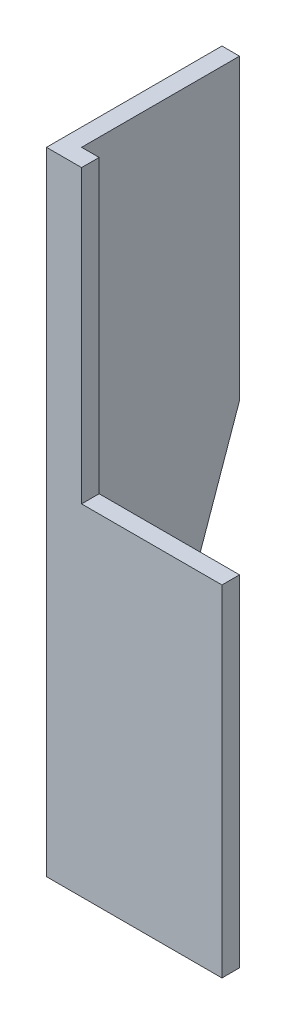
ISO-10303-21;
HEADER;
FILE_DESCRIPTION(('STEP AP214'),'2;1');
FILE_NAME('part.step','',(''),(''),'','','');
FILE_SCHEMA(('AUTOMOTIVE_DESIGN { 1 0 10303 214 1 1 1 1 }'));
ENDSEC;
DATA;
#1=APPLICATION_CONTEXT('core data for automotive mechanical design processes');
#2=APPLICATION_PROTOCOL_DEFINITION('international standard','automotive_design',2000,#1);
#3=PRODUCT_CONTEXT('',#1,'mechanical');
#4=PRODUCT('Part','Part','',(#3));
#5=PRODUCT_RELATED_PRODUCT_CATEGORY('part','',(#4));
#6=PRODUCT_DEFINITION_FORMATION('','',#4);
#7=PRODUCT_DEFINITION_CONTEXT('part definition',#1,'design');
#8=PRODUCT_DEFINITION('design','',#6,#7);
#9=PRODUCT_DEFINITION_SHAPE('','',#8);
#10=(LENGTH_UNIT() NAMED_UNIT(*) SI_UNIT(.MILLI.,.METRE.));
#11=(NAMED_UNIT(*) PLANE_ANGLE_UNIT() SI_UNIT($,.RADIAN.));
#12=(NAMED_UNIT(*) SI_UNIT($,.STERADIAN.) SOLID_ANGLE_UNIT());
#13=UNCERTAINTY_MEASURE_WITH_UNIT(LENGTH_MEASURE(1.E-05),#10,'distance_accuracy_value','');
#14=(GEOMETRIC_REPRESENTATION_CONTEXT(3) GLOBAL_UNCERTAINTY_ASSIGNED_CONTEXT((#13)) GLOBAL_UNIT_ASSIGNED_CONTEXT((#10,
#11,#12)) REPRESENTATION_CONTEXT('',''));
#15=CARTESIAN_POINT('',(0.,0.,0.));
#16=DIRECTION('',(0.,0.,1.));
#17=DIRECTION('',(1.,0.,0.));
#18=AXIS2_PLACEMENT_3D('',#15,#16,#17);
#19=CARTESIAN_POINT('',(5.00000000000006,180.,-5.00000000000012));
#20=DIRECTION('',(-0.999999999999998,0.,0.));
#21=DIRECTION('',(0.,0.,1.));
#22=AXIS2_PLACEMENT_3D('',#19,#20,#21);
#23=PLANE('',#22);
#24=DIRECTION('',(0.,0.943599982132881,-0.331087713029081));
#25=VECTOR('',#24,1.);
#26=CARTESIAN_POINT('',(5.00000000000017,-5.2069060016447,-14.8396821046863));
#27=LINE('',#26,#25);
#28=CARTESIAN_POINT('',(5.00000000000014,-1.99840144432528E-12,-16.6666666666676));
#29=VERTEX_POINT('',#28);
#30=CARTESIAN_POINT('',(5.00000000000014,94.9999999999977,-50.0000000000004));
#31=VERTEX_POINT('',#30);
#32=EDGE_CURVE('E61',#29,#31,#27,.T.);
#33=ORIENTED_EDGE('',*,*,#32,.T.);
#34=DIRECTION('',(0.,-1.,0.));
#35=VECTOR('',#34,1.);
#36=CARTESIAN_POINT('',(5.00000000000009,179.999999999997,-50.0000000000018));
#37=LINE('',#36,#35);
#38=CARTESIAN_POINT('',(5.00000000000009,179.999999999997,-50.0000000000018));
#39=VERTEX_POINT('',#38);
#40=EDGE_CURVE('E158',#39,#31,#37,.T.);
#41=ORIENTED_EDGE('',*,*,#40,.F.);
#42=DIRECTION('',(0.,0.,-1.));
#43=VECTOR('',#42,1.);
#44=CARTESIAN_POINT('',(5.00000000000006,180.,-5.00000000000012));
#45=LINE('',#44,#43);
#46=CARTESIAN_POINT('',(5.00000000000006,180.,-5.00000000000012));
#47=VERTEX_POINT('',#46);
#48=EDGE_CURVE('E131',#47,#39,#45,.T.);
#49=ORIENTED_EDGE('',*,*,#48,.F.);
#50=DIRECTION('',(0.,-1.,0.));
#51=VECTOR('',#50,1.);
#52=CARTESIAN_POINT('',(5.00000000000006,180.,-5.00000000000012));
#53=LINE('',#52,#51);
#54=CARTESIAN_POINT('',(4.99999999999987,-2.99760216648792E-12,-5.00000000000111));
#55=VERTEX_POINT('',#54);
#56=EDGE_CURVE('E161',#47,#55,#53,.T.);
#57=ORIENTED_EDGE('',*,*,#56,.T.);
#58=DIRECTION('',(0.,0.,-1.));
#59=VECTOR('',#58,1.);
#60=CARTESIAN_POINT('',(4.99999999999987,-2.99760216648792E-12,-5.00000000000111));
#61=LINE('',#60,#59);
#62=EDGE_CURVE('E133',#55,#29,#61,.T.);
#63=ORIENTED_EDGE('',*,*,#62,.T.);
#64=EDGE_LOOP('',(#33,#41,#49,#57,#63));
#65=FACE_BOUND('',#64,.T.);
#66=ADVANCED_FACE('F38',(#65),#23,.F.);
#67=CARTESIAN_POINT('',(0.,179.999999999999,-50.0000000000004));
#68=DIRECTION('',(0.,0.,1.));
#69=DIRECTION('',(0.999999999999998,0.,0.));
#70=AXIS2_PLACEMENT_3D('',#67,#68,#69);
#71=PLANE('',#70);
#72=DIRECTION('',(-0.999999999999998,0.,0.));
#73=VECTOR('',#72,1.);
#74=CARTESIAN_POINT('',(105.678255403593,94.9999999999996,-50.0000000000003));
#75=LINE('',#74,#73);
#76=CARTESIAN_POINT('',(1.38777878078145E-13,94.9999999999992,-50.0000000000002));
#77=VERTEX_POINT('',#76);
#78=EDGE_CURVE('E136',#31,#77,#75,.T.);
#79=ORIENTED_EDGE('',*,*,#78,.T.);
#80=DIRECTION('',(0.,-1.,0.));
#81=VECTOR('',#80,1.);
#82=CARTESIAN_POINT('',(0.,179.999999999999,-50.0000000000004));
#83=LINE('',#82,#81);
#84=CARTESIAN_POINT('',(0.,179.999999999999,-50.0000000000004));
#85=VERTEX_POINT('',#84);
#86=EDGE_CURVE('E155',#85,#77,#83,.T.);
#87=ORIENTED_EDGE('',*,*,#86,.F.);
#88=DIRECTION('',(-0.999999999999998,0.,0.));
#89=VECTOR('',#88,1.);
#90=CARTESIAN_POINT('',(0.,179.999999999999,-50.0000000000004));
#91=LINE('',#90,#89);
#92=EDGE_CURVE('E140',#39,#85,#91,.T.);
#93=ORIENTED_EDGE('',*,*,#92,.F.);
#94=ORIENTED_EDGE('',*,*,#40,.T.);
#95=EDGE_LOOP('',(#79,#87,#93,#94));
#96=FACE_BOUND('',#95,.T.);
#97=ADVANCED_FACE('F187',(#96),#71,.F.);
#98=CARTESIAN_POINT('',(-1.66533453693773E-13,179.999999999997,-6.66133814775094E-13));
#99=DIRECTION('',(0.999999999999998,0.,0.));
#100=DIRECTION('',(0.,0.,-1.));
#101=AXIS2_PLACEMENT_3D('',#98,#99,#100);
#102=PLANE('',#101);
#103=DIRECTION('',(0.,-0.943599982132881,0.331087713029081));
#104=VECTOR('',#103,1.);
#105=CARTESIAN_POINT('',(5.96744875736022E-13,-5.20690600164764,-14.8396821046874));
#106=LINE('',#105,#104);
#107=CARTESIAN_POINT('',(2.35922392732846E-13,-7.21644966006352E-13,-16.6666666666668));
#108=VERTEX_POINT('',#107);
#109=EDGE_CURVE('E191',#77,#108,#106,.T.);
#110=ORIENTED_EDGE('',*,*,#109,.T.);
#111=DIRECTION('',(0.,0.,1.));
#112=VECTOR('',#111,1.);
#113=CARTESIAN_POINT('',(0.,0.,0.));
#114=LINE('',#113,#112);
#115=CARTESIAN_POINT('',(0.,0.,0.));
#116=VERTEX_POINT('',#115);
#117=EDGE_CURVE('E129',#108,#116,#114,.T.);
#118=ORIENTED_EDGE('',*,*,#117,.T.);
#119=DIRECTION('',(0.,-1.,0.));
#120=VECTOR('',#119,1.);
#121=CARTESIAN_POINT('',(-1.66533453693773E-13,179.999999999997,-6.66133814775094E-13));
#122=LINE('',#121,#120);
#123=CARTESIAN_POINT('',(-1.66533453693773E-13,179.999999999997,-6.66133814775094E-13));
#124=VERTEX_POINT('',#123);
#125=EDGE_CURVE('E143',#124,#116,#122,.T.);
#126=ORIENTED_EDGE('',*,*,#125,.F.);
#127=DIRECTION('',(0.,0.,1.));
#128=VECTOR('',#127,1.);
#129=CARTESIAN_POINT('',(-1.66533453693773E-13,179.999999999997,-6.66133814775094E-13));
#130=LINE('',#129,#128);
#131=EDGE_CURVE('E126',#85,#124,#130,.T.);
#132=ORIENTED_EDGE('',*,*,#131,.F.);
#133=ORIENTED_EDGE('',*,*,#86,.T.);
#134=EDGE_LOOP('',(#110,#118,#126,#132,#133));
#135=FACE_BOUND('',#134,.T.);
#136=ADVANCED_FACE('F190',(#135),#102,.F.);
#137=CARTESIAN_POINT('',(0.,0.,0.));
#138=DIRECTION('',(0.,-1.,0.));
#139=DIRECTION('',(0.,0.,-1.));
#140=AXIS2_PLACEMENT_3D('',#137,#138,#139);
#141=PLANE('',#140);
#142=ORIENTED_EDGE('',*,*,#117,.F.);
#143=DIRECTION('',(-0.999999999999998,0.,0.));
#144=VECTOR('',#143,1.);
#145=CARTESIAN_POINT('',(105.678255403593,-5.55111512312578E-13,-16.6666666666671));
#146=LINE('',#145,#144);
#147=EDGE_CURVE('E179',#29,#108,#146,.T.);
#148=ORIENTED_EDGE('',*,*,#147,.F.);
#149=ORIENTED_EDGE('',*,*,#62,.F.);
#150=DIRECTION('',(-0.999999999999998,0.,0.));
#151=VECTOR('',#150,1.);
#152=CARTESIAN_POINT('',(4.99999999999987,-2.99760216648792E-12,-5.00000000000111));
#153=LINE('',#152,#151);
#154=CARTESIAN_POINT('',(50.0000000000001,-3.60822483003176E-12,-5.00000000000106));
#155=VERTEX_POINT('',#154);
#156=EDGE_CURVE('E150',#155,#55,#153,.T.);
#157=ORIENTED_EDGE('',*,*,#156,.F.);
#158=DIRECTION('',(0.,0.,-1.));
#159=VECTOR('',#158,1.);
#160=CARTESIAN_POINT('',(50.0000000000001,-3.60822483003176E-12,-5.00000000000106));
#161=LINE('',#160,#159);
#162=CARTESIAN_POINT('',(50.0000000000002,-3.33066907387547E-12,-1.16573417585641E-12));
#163=VERTEX_POINT('',#162);
#164=EDGE_CURVE('E147',#163,#155,#161,.T.);
#165=ORIENTED_EDGE('',*,*,#164,.F.);
#166=DIRECTION('',(0.999999999999998,0.,0.));
#167=VECTOR('',#166,1.);
#168=CARTESIAN_POINT('',(0.,0.,0.));
#169=LINE('',#168,#167);
#170=EDGE_CURVE('E144',#116,#163,#169,.T.);
#171=ORIENTED_EDGE('',*,*,#170,.F.);
#172=EDGE_LOOP('',(#142,#148,#149,#157,#165,#171));
#173=FACE_BOUND('',#172,.T.);
#174=ADVANCED_FACE('F178',(#173),#141,.T.);
#175=CARTESIAN_POINT('',(-1.66533453693773E-13,179.999999999997,-6.66133814775094E-13));
#176=DIRECTION('',(0.,0.,-1.));
#177=DIRECTION('',(-0.999999999999998,0.,0.));
#178=AXIS2_PLACEMENT_3D('',#175,#176,#177);
#179=PLANE('',#178);
#180=DIRECTION('',(0.,-1.,0.));
#181=VECTOR('',#180,1.);
#182=CARTESIAN_POINT('',(49.9999999999998,180.,0.));
#183=LINE('',#182,#181);
#184=CARTESIAN_POINT('',(49.9999999999997,96.9999999999966,-1.0547118733939E-12));
#185=VERTEX_POINT('',#184);
#186=EDGE_CURVE('E11',#185,#163,#183,.T.);
#187=ORIENTED_EDGE('',*,*,#186,.F.);
#188=DIRECTION('',(0.999999999999998,0.,0.));
#189=VECTOR('',#188,1.);
#190=CARTESIAN_POINT('',(49.9999999999997,96.9999999999966,-1.0547118733939E-12));
#191=LINE('',#190,#189);
#192=CARTESIAN_POINT('',(10.0000000000002,97.,0.));
#193=VERTEX_POINT('',#192);
#194=EDGE_CURVE('E116',#193,#185,#191,.T.);
#195=ORIENTED_EDGE('',*,*,#194,.F.);
#196=DIRECTION('',(0.,-1.,0.));
#197=VECTOR('',#196,1.);
#198=CARTESIAN_POINT('',(10.,179.999999999997,-5.55111512312578E-13));
#199=LINE('',#198,#197);
#200=CARTESIAN_POINT('',(10.,179.999999999997,-5.55111512312578E-13));
#201=VERTEX_POINT('',#200);
#202=EDGE_CURVE('E110',#201,#193,#199,.T.);
#203=ORIENTED_EDGE('',*,*,#202,.F.);
#204=DIRECTION('',(0.999999999999998,0.,0.));
#205=VECTOR('',#204,1.);
#206=CARTESIAN_POINT('',(-1.66533453693773E-13,179.999999999997,-6.66133814775094E-13));
#207=LINE('',#206,#205);
#208=EDGE_CURVE('E122',#124,#201,#207,.T.);
#209=ORIENTED_EDGE('',*,*,#208,.F.);
#210=ORIENTED_EDGE('',*,*,#125,.T.);
#211=ORIENTED_EDGE('',*,*,#170,.T.);
#212=EDGE_LOOP('',(#187,#195,#203,#209,#210,#211));
#213=FACE_BOUND('',#212,.T.);
#214=ADVANCED_FACE('F40',(#213),#179,.F.);
#215=CARTESIAN_POINT('',(49.9999999999999,179.999999999997,-5.00000000000039));
#216=DIRECTION('',(-0.999999999999998,0.,0.));
#217=DIRECTION('',(0.,0.,1.));
#218=AXIS2_PLACEMENT_3D('',#215,#216,#217);
#219=PLANE('',#218);
#220=DIRECTION('',(0.,-1.,0.));
#221=VECTOR('',#220,1.);
#222=CARTESIAN_POINT('',(49.9999999999999,179.999999999997,-5.00000000000039));
#223=LINE('',#222,#221);
#224=CARTESIAN_POINT('',(50.,97.,-4.99999999999995));
#225=VERTEX_POINT('',#224);
#226=EDGE_CURVE('E46',#225,#155,#223,.T.);
#227=ORIENTED_EDGE('',*,*,#226,.F.);
#228=DIRECTION('',(0.,0.,1.));
#229=VECTOR('',#228,1.);
#230=CARTESIAN_POINT('',(50.0000000000001,96.9999999999969,-97.1357693841001));
#231=LINE('',#230,#229);
#232=EDGE_CURVE('E284',#225,#185,#231,.T.);
#233=ORIENTED_EDGE('',*,*,#232,.T.);
#234=ORIENTED_EDGE('',*,*,#186,.T.);
#235=ORIENTED_EDGE('',*,*,#164,.T.);
#236=EDGE_LOOP('',(#227,#233,#234,#235));
#237=FACE_BOUND('',#236,.T.);
#238=ADVANCED_FACE('F173',(#237),#219,.F.);
#239=CARTESIAN_POINT('',(5.00000000000006,180.,-5.00000000000012));
#240=DIRECTION('',(0.,0.,1.));
#241=DIRECTION('',(0.999999999999998,0.,0.));
#242=AXIS2_PLACEMENT_3D('',#239,#240,#241);
#243=PLANE('',#242);
#244=DIRECTION('',(0.,1.,0.));
#245=VECTOR('',#244,1.);
#246=CARTESIAN_POINT('',(9.99999999999995,180.,-5.));
#247=LINE('',#246,#245);
#248=CARTESIAN_POINT('',(10.0000000000001,96.9999999999997,-5.));
#249=VERTEX_POINT('',#248);
#250=CARTESIAN_POINT('',(9.99999999999995,180.,-5.));
#251=VERTEX_POINT('',#250);
#252=EDGE_CURVE('E53',#249,#251,#247,.T.);
#253=ORIENTED_EDGE('',*,*,#252,.F.);
#254=DIRECTION('',(-0.999999999999998,0.,0.));
#255=VECTOR('',#254,1.);
#256=CARTESIAN_POINT('',(50.,97.,-4.99999999999995));
#257=LINE('',#256,#255);
#258=EDGE_CURVE('E169',#225,#249,#257,.T.);
#259=ORIENTED_EDGE('',*,*,#258,.F.);
#260=ORIENTED_EDGE('',*,*,#226,.T.);
#261=ORIENTED_EDGE('',*,*,#156,.T.);
#262=ORIENTED_EDGE('',*,*,#56,.F.);
#263=DIRECTION('',(-0.999999999999998,0.,0.));
#264=VECTOR('',#263,1.);
#265=CARTESIAN_POINT('',(5.00000000000006,180.,-5.00000000000012));
#266=LINE('',#265,#264);
#267=EDGE_CURVE('E128',#251,#47,#266,.T.);
#268=ORIENTED_EDGE('',*,*,#267,.F.);
#269=EDGE_LOOP('',(#253,#259,#260,#261,#262,#268));
#270=FACE_BOUND('',#269,.T.);
#271=ADVANCED_FACE('F166',(#270),#243,.F.);
#272=CARTESIAN_POINT('',(-1.66533453693773E-13,179.999999999997,-6.66133814775094E-13));
#273=DIRECTION('',(0.,-1.,0.));
#274=DIRECTION('',(0.,0.,-1.));
#275=AXIS2_PLACEMENT_3D('',#272,#273,#274);
#276=PLANE('',#275);
#277=ORIENTED_EDGE('',*,*,#208,.T.);
#278=DIRECTION('',(0.,0.,1.));
#279=VECTOR('',#278,1.);
#280=CARTESIAN_POINT('',(9.99999999999973,179.999999999998,-97.1357693841007));
#281=LINE('',#280,#279);
#282=EDGE_CURVE('E107',#251,#201,#281,.T.);
#283=ORIENTED_EDGE('',*,*,#282,.F.);
#284=ORIENTED_EDGE('',*,*,#267,.T.);
#285=ORIENTED_EDGE('',*,*,#48,.T.);
#286=ORIENTED_EDGE('',*,*,#92,.T.);
#287=ORIENTED_EDGE('',*,*,#131,.T.);
#288=EDGE_LOOP('',(#277,#283,#284,#285,#286,#287));
#289=FACE_BOUND('',#288,.T.);
#290=ADVANCED_FACE('F124',(#289),#276,.F.);
#291=CARTESIAN_POINT('',(105.678255403593,-5.20690600164742,-14.8396821046871));
#292=DIRECTION('',(0.,-0.331087713029081,-0.943599982132881));
#293=DIRECTION('',(0.,0.943599982132881,-0.331087713029081));
#294=AXIS2_PLACEMENT_3D('',#291,#292,#293);
#295=PLANE('',#294);
#296=ORIENTED_EDGE('',*,*,#147,.T.);
#297=ORIENTED_EDGE('',*,*,#109,.F.);
#298=ORIENTED_EDGE('',*,*,#78,.F.);
#299=ORIENTED_EDGE('',*,*,#32,.F.);
#300=EDGE_LOOP('',(#296,#297,#298,#299));
#301=FACE_BOUND('',#300,.T.);
#302=ADVANCED_FACE('F195',(#301),#295,.T.);
#303=CARTESIAN_POINT('',(50.0000000000001,96.9999999999969,-97.1357693841001));
#304=DIRECTION('',(0.,-1.,0.));
#305=DIRECTION('',(0.,0.,-1.));
#306=AXIS2_PLACEMENT_3D('',#303,#304,#305);
#307=PLANE('',#306);
#308=ORIENTED_EDGE('',*,*,#258,.T.);
#309=DIRECTION('',(0.,0.,1.));
#310=VECTOR('',#309,1.);
#311=CARTESIAN_POINT('',(9.99999999999979,96.9999999999984,-97.1357693841002));
#312=LINE('',#311,#310);
#313=EDGE_CURVE('E115',#249,#193,#312,.T.);
#314=ORIENTED_EDGE('',*,*,#313,.T.);
#315=ORIENTED_EDGE('',*,*,#194,.T.);
#316=ORIENTED_EDGE('',*,*,#232,.F.);
#317=EDGE_LOOP('',(#308,#314,#315,#316));
#318=FACE_BOUND('',#317,.T.);
#319=ADVANCED_FACE('F197',(#318),#307,.F.);
#320=CARTESIAN_POINT('',(9.99999999999973,179.999999999998,-97.1357693841007));
#321=DIRECTION('',(-0.999999999999999,0.,0.));
#322=DIRECTION('',(0.,-1.,0.));
#323=AXIS2_PLACEMENT_3D('',#320,#321,#322);
#324=PLANE('',#323);
#325=ORIENTED_EDGE('',*,*,#252,.T.);
#326=ORIENTED_EDGE('',*,*,#282,.T.);
#327=ORIENTED_EDGE('',*,*,#202,.T.);
#328=ORIENTED_EDGE('',*,*,#313,.F.);
#329=EDGE_LOOP('',(#325,#326,#327,#328));
#330=FACE_BOUND('',#329,.T.);
#331=ADVANCED_FACE('F109',(#330),#324,.F.);
#332=CLOSED_SHELL('',(#66,#97,#136,#174,#214,#238,#271,#290,#302,#319,#331));
#333=MANIFOLD_SOLID_BREP('B2',#332);
#334=ADVANCED_BREP_SHAPE_REPRESENTATION('',(#18,#333),#14);
#335=SHAPE_DEFINITION_REPRESENTATION(#9,#334);
ENDSEC;
END-ISO-10303-21;
